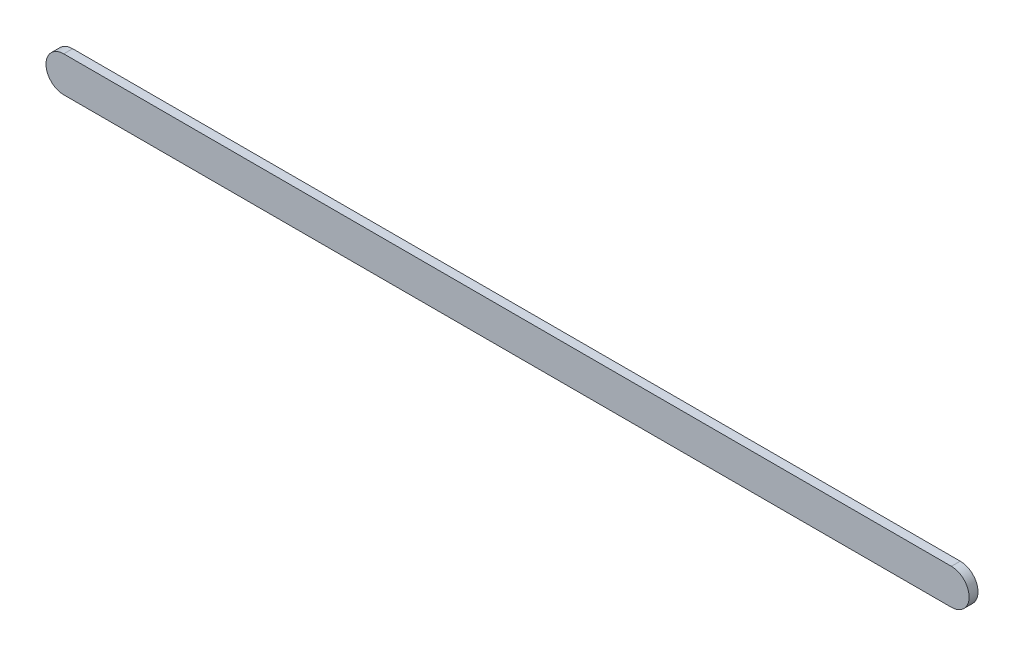
ISO-10303-21;
HEADER;
FILE_DESCRIPTION(('STEP AP214'),'2;1');
FILE_NAME('part.step','',(''),(''),'','','');
FILE_SCHEMA(('AUTOMOTIVE_DESIGN { 1 0 10303 214 1 1 1 1 }'));
ENDSEC;
DATA;
#1=APPLICATION_CONTEXT('core data for automotive mechanical design processes');
#2=APPLICATION_PROTOCOL_DEFINITION('international standard','automotive_design',2000,#1);
#3=PRODUCT_CONTEXT('',#1,'mechanical');
#4=PRODUCT('Part','Part','',(#3));
#5=PRODUCT_RELATED_PRODUCT_CATEGORY('part','',(#4));
#6=PRODUCT_DEFINITION_FORMATION('','',#4);
#7=PRODUCT_DEFINITION_CONTEXT('part definition',#1,'design');
#8=PRODUCT_DEFINITION('design','',#6,#7);
#9=PRODUCT_DEFINITION_SHAPE('','',#8);
#10=(LENGTH_UNIT() NAMED_UNIT(*) SI_UNIT(.MILLI.,.METRE.));
#11=(NAMED_UNIT(*) PLANE_ANGLE_UNIT() SI_UNIT($,.RADIAN.));
#12=(NAMED_UNIT(*) SI_UNIT($,.STERADIAN.) SOLID_ANGLE_UNIT());
#13=UNCERTAINTY_MEASURE_WITH_UNIT(LENGTH_MEASURE(1.E-05),#10,'distance_accuracy_value','');
#14=(GEOMETRIC_REPRESENTATION_CONTEXT(3) GLOBAL_UNCERTAINTY_ASSIGNED_CONTEXT((#13)) GLOBAL_UNIT_ASSIGNED_CONTEXT((#10,
#11,#12)) REPRESENTATION_CONTEXT('',''));
#15=CARTESIAN_POINT('',(0.,0.,0.));
#16=DIRECTION('',(0.,0.,1.));
#17=DIRECTION('',(1.,0.,0.));
#18=AXIS2_PLACEMENT_3D('',#15,#16,#17);
#19=CARTESIAN_POINT('',(-75.937752546146,0.,2.5));
#20=DIRECTION('',(0.,0.,-1.));
#21=DIRECTION('',(-1.,0.,0.));
#22=AXIS2_PLACEMENT_3D('',#19,#20,#21);
#23=CYLINDRICAL_SURFACE('',#22,5.);
#24=CARTESIAN_POINT('',(-75.937752546146,0.,0.));
#25=DIRECTION('',(0.,0.,1.));
#26=DIRECTION('',(1.,0.,0.));
#27=AXIS2_PLACEMENT_3D('',#24,#25,#26);
#28=CIRCLE('',#27,5.);
#29=CARTESIAN_POINT('',(-75.937752546146,5.,0.));
#30=VERTEX_POINT('',#29);
#31=CARTESIAN_POINT('',(-75.937752546146,-5.,0.));
#32=VERTEX_POINT('',#31);
#33=EDGE_CURVE('E96',#30,#32,#28,.T.);
#34=ORIENTED_EDGE('',*,*,#33,.T.);
#35=DIRECTION('',(0.,0.,-1.));
#36=VECTOR('',#35,1.);
#37=CARTESIAN_POINT('',(-75.937752546146,-5.,2.5));
#38=LINE('',#37,#36);
#39=CARTESIAN_POINT('',(-75.937752546146,-5.,2.5));
#40=VERTEX_POINT('',#39);
#41=EDGE_CURVE('E11',#40,#32,#38,.T.);
#42=ORIENTED_EDGE('',*,*,#41,.F.);
#43=CARTESIAN_POINT('',(-75.937752546146,0.,2.5));
#44=DIRECTION('',(0.,0.,1.));
#45=DIRECTION('',(1.,0.,0.));
#46=AXIS2_PLACEMENT_3D('',#43,#44,#45);
#47=CIRCLE('',#46,5.);
#48=CARTESIAN_POINT('',(-75.937752546146,5.,2.5));
#49=VERTEX_POINT('',#48);
#50=EDGE_CURVE('E84',#49,#40,#47,.T.);
#51=ORIENTED_EDGE('',*,*,#50,.F.);
#52=DIRECTION('',(0.,0.,-1.));
#53=VECTOR('',#52,1.);
#54=CARTESIAN_POINT('',(-75.937752546146,5.,2.5));
#55=LINE('',#54,#53);
#56=EDGE_CURVE('E92',#49,#30,#55,.T.);
#57=ORIENTED_EDGE('',*,*,#56,.T.);
#58=EDGE_LOOP('',(#34,#42,#51,#57));
#59=FACE_BOUND('',#58,.T.);
#60=ADVANCED_FACE('F33',(#59),#23,.T.);
#61=CARTESIAN_POINT('',(-75.937752546146,-5.,2.5));
#62=DIRECTION('',(0.,1.,0.));
#63=DIRECTION('',(0.,0.,1.));
#64=AXIS2_PLACEMENT_3D('',#61,#62,#63);
#65=PLANE('',#64);
#66=DIRECTION('',(1.,0.,0.));
#67=VECTOR('',#66,1.);
#68=CARTESIAN_POINT('',(-75.937752546146,-5.,0.));
#69=LINE('',#68,#67);
#70=CARTESIAN_POINT('',(174.062247453854,-5.,0.));
#71=VERTEX_POINT('',#70);
#72=EDGE_CURVE('E88',#32,#71,#69,.T.);
#73=ORIENTED_EDGE('',*,*,#72,.T.);
#74=DIRECTION('',(0.,0.,-1.));
#75=VECTOR('',#74,1.);
#76=CARTESIAN_POINT('',(174.062247453854,-5.,2.5));
#77=LINE('',#76,#75);
#78=CARTESIAN_POINT('',(174.062247453854,-5.,2.5));
#79=VERTEX_POINT('',#78);
#80=EDGE_CURVE('E41',#79,#71,#77,.T.);
#81=ORIENTED_EDGE('',*,*,#80,.F.);
#82=DIRECTION('',(1.,0.,0.));
#83=VECTOR('',#82,1.);
#84=CARTESIAN_POINT('',(-75.937752546146,-5.,2.5));
#85=LINE('',#84,#83);
#86=EDGE_CURVE('E79',#40,#79,#85,.T.);
#87=ORIENTED_EDGE('',*,*,#86,.F.);
#88=ORIENTED_EDGE('',*,*,#41,.T.);
#89=EDGE_LOOP('',(#73,#81,#87,#88));
#90=FACE_BOUND('',#89,.T.);
#91=ADVANCED_FACE('F87',(#90),#65,.F.);
#92=CARTESIAN_POINT('',(174.062247453854,0.,2.5));
#93=DIRECTION('',(0.,0.,-1.));
#94=DIRECTION('',(-1.,0.,0.));
#95=AXIS2_PLACEMENT_3D('',#92,#93,#94);
#96=CYLINDRICAL_SURFACE('',#95,5.);
#97=CARTESIAN_POINT('',(174.062247453854,0.,0.));
#98=DIRECTION('',(0.,0.,1.));
#99=DIRECTION('',(1.,0.,0.));
#100=AXIS2_PLACEMENT_3D('',#97,#98,#99);
#101=CIRCLE('',#100,5.);
#102=CARTESIAN_POINT('',(174.062247453854,5.,0.));
#103=VERTEX_POINT('',#102);
#104=EDGE_CURVE('E66',#71,#103,#101,.T.);
#105=ORIENTED_EDGE('',*,*,#104,.T.);
#106=DIRECTION('',(0.,0.,-1.));
#107=VECTOR('',#106,1.);
#108=CARTESIAN_POINT('',(174.062247453854,5.,2.5));
#109=LINE('',#108,#107);
#110=CARTESIAN_POINT('',(174.062247453854,5.,2.5));
#111=VERTEX_POINT('',#110);
#112=EDGE_CURVE('E89',#111,#103,#109,.T.);
#113=ORIENTED_EDGE('',*,*,#112,.F.);
#114=CARTESIAN_POINT('',(174.062247453854,0.,2.5));
#115=DIRECTION('',(0.,0.,1.));
#116=DIRECTION('',(1.,0.,0.));
#117=AXIS2_PLACEMENT_3D('',#114,#115,#116);
#118=CIRCLE('',#117,5.);
#119=EDGE_CURVE('E82',#79,#111,#118,.T.);
#120=ORIENTED_EDGE('',*,*,#119,.F.);
#121=ORIENTED_EDGE('',*,*,#80,.T.);
#122=EDGE_LOOP('',(#105,#113,#120,#121));
#123=FACE_BOUND('',#122,.T.);
#124=ADVANCED_FACE('F90',(#123),#96,.T.);
#125=CARTESIAN_POINT('',(-75.937752546146,5.,2.5));
#126=DIRECTION('',(0.,-1.,0.));
#127=DIRECTION('',(0.,0.,-1.));
#128=AXIS2_PLACEMENT_3D('',#125,#126,#127);
#129=PLANE('',#128);
#130=DIRECTION('',(-1.,0.,0.));
#131=VECTOR('',#130,1.);
#132=CARTESIAN_POINT('',(-75.937752546146,5.,0.));
#133=LINE('',#132,#131);
#134=EDGE_CURVE('E72',#103,#30,#133,.T.);
#135=ORIENTED_EDGE('',*,*,#134,.T.);
#136=ORIENTED_EDGE('',*,*,#56,.F.);
#137=DIRECTION('',(-1.,0.,0.));
#138=VECTOR('',#137,1.);
#139=CARTESIAN_POINT('',(-75.937752546146,5.,2.5));
#140=LINE('',#139,#138);
#141=EDGE_CURVE('E49',#111,#49,#140,.T.);
#142=ORIENTED_EDGE('',*,*,#141,.F.);
#143=ORIENTED_EDGE('',*,*,#112,.T.);
#144=EDGE_LOOP('',(#135,#136,#142,#143));
#145=FACE_BOUND('',#144,.T.);
#146=ADVANCED_FACE('F103',(#145),#129,.F.);
#147=CARTESIAN_POINT('',(-75.937752546146,0.,2.5));
#148=DIRECTION('',(0.,0.,1.));
#149=DIRECTION('',(1.,0.,0.));
#150=AXIS2_PLACEMENT_3D('',#147,#148,#149);
#151=PLANE('',#150);
#152=ORIENTED_EDGE('',*,*,#50,.T.);
#153=ORIENTED_EDGE('',*,*,#86,.T.);
#154=ORIENTED_EDGE('',*,*,#119,.T.);
#155=ORIENTED_EDGE('',*,*,#141,.T.);
#156=EDGE_LOOP('',(#152,#153,#154,#155));
#157=FACE_BOUND('',#156,.T.);
#158=ADVANCED_FACE('F80',(#157),#151,.T.);
#159=CARTESIAN_POINT('',(-75.937752546146,0.,0.));
#160=DIRECTION('',(0.,0.,1.));
#161=DIRECTION('',(1.,0.,0.));
#162=AXIS2_PLACEMENT_3D('',#159,#160,#161);
#163=PLANE('',#162);
#164=ORIENTED_EDGE('',*,*,#33,.F.);
#165=ORIENTED_EDGE('',*,*,#134,.F.);
#166=ORIENTED_EDGE('',*,*,#104,.F.);
#167=ORIENTED_EDGE('',*,*,#72,.F.);
#168=EDGE_LOOP('',(#164,#165,#166,#167));
#169=FACE_BOUND('',#168,.T.);
#170=ADVANCED_FACE('F106',(#169),#163,.F.);
#171=CLOSED_SHELL('',(#60,#91,#124,#146,#158,#170));
#172=MANIFOLD_SOLID_BREP('B2',#171);
#173=ADVANCED_BREP_SHAPE_REPRESENTATION('',(#18,#172),#14);
#174=SHAPE_DEFINITION_REPRESENTATION(#9,#173);
ENDSEC;
END-ISO-10303-21;
